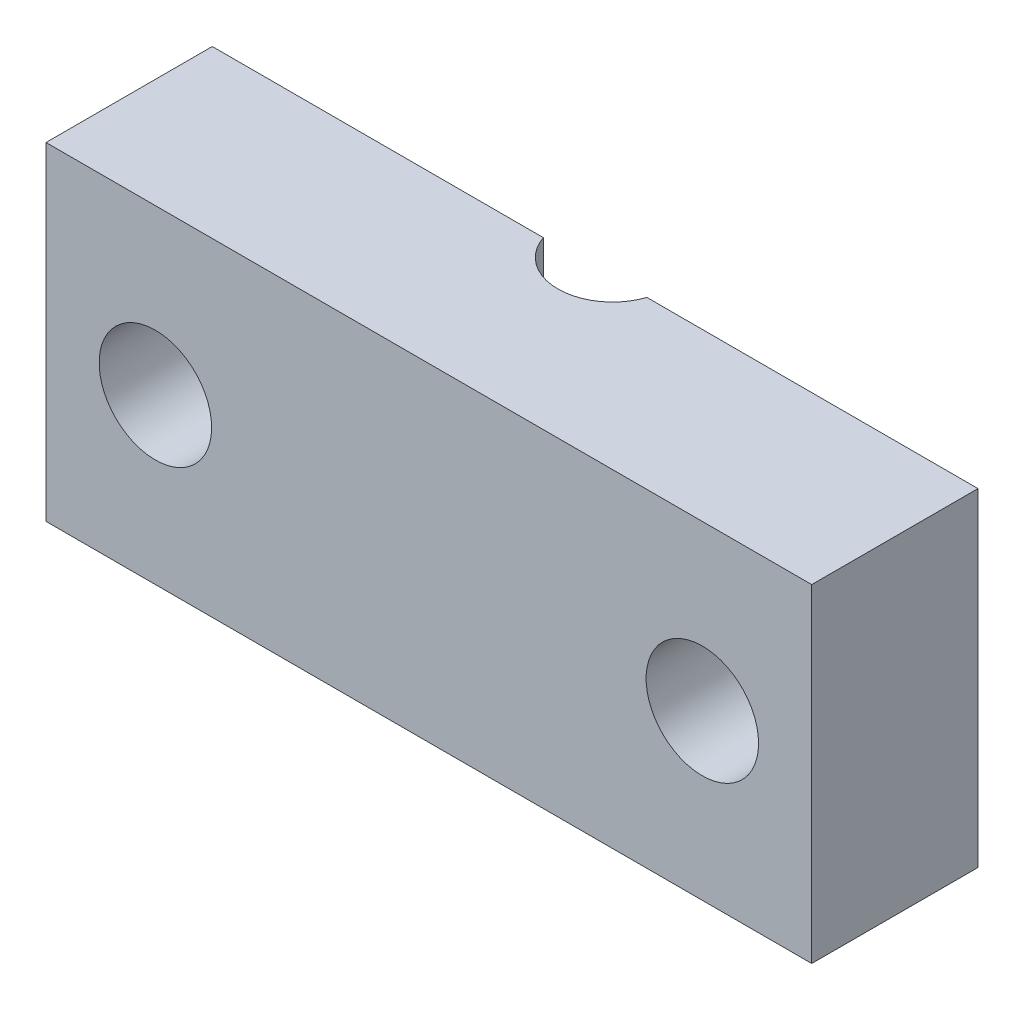
ISO-10303-21;
HEADER;
FILE_DESCRIPTION(('STEP AP214'),'2;1');
FILE_NAME('part.step','',(''),(''),'','','');
FILE_SCHEMA(('AUTOMOTIVE_DESIGN { 1 0 10303 214 1 1 1 1 }'));
ENDSEC;
DATA;
#1=APPLICATION_CONTEXT('core data for automotive mechanical design processes');
#2=APPLICATION_PROTOCOL_DEFINITION('international standard','automotive_design',2000,#1);
#3=PRODUCT_CONTEXT('',#1,'mechanical');
#4=PRODUCT('Part','Part','',(#3));
#5=PRODUCT_RELATED_PRODUCT_CATEGORY('part','',(#4));
#6=PRODUCT_DEFINITION_FORMATION('','',#4);
#7=PRODUCT_DEFINITION_CONTEXT('part definition',#1,'design');
#8=PRODUCT_DEFINITION('design','',#6,#7);
#9=PRODUCT_DEFINITION_SHAPE('','',#8);
#10=(LENGTH_UNIT() NAMED_UNIT(*) SI_UNIT(.MILLI.,.METRE.));
#11=(NAMED_UNIT(*) PLANE_ANGLE_UNIT() SI_UNIT($,.RADIAN.));
#12=(NAMED_UNIT(*) SI_UNIT($,.STERADIAN.) SOLID_ANGLE_UNIT());
#13=UNCERTAINTY_MEASURE_WITH_UNIT(LENGTH_MEASURE(1.E-05),#10,'distance_accuracy_value','');
#14=(GEOMETRIC_REPRESENTATION_CONTEXT(3) GLOBAL_UNCERTAINTY_ASSIGNED_CONTEXT((#13)) GLOBAL_UNIT_ASSIGNED_CONTEXT((#10,
#11,#12)) REPRESENTATION_CONTEXT('',''));
#15=CARTESIAN_POINT('',(0.,0.,0.));
#16=DIRECTION('',(0.,0.,1.));
#17=DIRECTION('',(1.,0.,0.));
#18=AXIS2_PLACEMENT_3D('',#15,#16,#17);
#19=CARTESIAN_POINT('',(-25.2368326571727,19.05,7.68795930098237));
#20=DIRECTION('',(0.,-1.,0.));
#21=DIRECTION('',(0.,0.,-1.));
#22=AXIS2_PLACEMENT_3D('',#19,#20,#21);
#23=CYLINDRICAL_SURFACE('',#22,3.175);
#24=CARTESIAN_POINT('',(-25.2368326571727,0.,7.68795930098237));
#25=DIRECTION('',(0.,1.,0.));
#26=DIRECTION('',(0.,0.,1.));
#27=AXIS2_PLACEMENT_3D('',#24,#25,#26);
#28=CIRCLE('',#27,3.175);
#29=CARTESIAN_POINT('',(-28.2448833548837,0.,8.70395930098237));
#30=VERTEX_POINT('',#29);
#31=CARTESIAN_POINT('',(-22.2287819594616,0.,8.70395930098237));
#32=VERTEX_POINT('',#31);
#33=EDGE_CURVE('E120',#30,#32,#28,.T.);
#34=ORIENTED_EDGE('',*,*,#33,.F.);
#35=DIRECTION('',(0.,-1.,0.));
#36=VECTOR('',#35,1.);
#37=CARTESIAN_POINT('',(-28.2448833548837,19.05,8.70395930098237));
#38=LINE('',#37,#36);
#39=CARTESIAN_POINT('',(-28.2448833548837,19.05,8.70395930098237));
#40=VERTEX_POINT('',#39);
#41=EDGE_CURVE('E11',#40,#30,#38,.T.);
#42=ORIENTED_EDGE('',*,*,#41,.F.);
#43=CARTESIAN_POINT('',(-25.2368326571727,19.05,7.68795930098237));
#44=DIRECTION('',(0.,1.,0.));
#45=DIRECTION('',(0.,0.,1.));
#46=AXIS2_PLACEMENT_3D('',#43,#44,#45);
#47=CIRCLE('',#46,3.175);
#48=CARTESIAN_POINT('',(-22.2287819594616,19.05,8.70395930098237));
#49=VERTEX_POINT('',#48);
#50=EDGE_CURVE('E145',#40,#49,#47,.T.);
#51=ORIENTED_EDGE('',*,*,#50,.T.);
#52=DIRECTION('',(0.,-1.,0.));
#53=VECTOR('',#52,1.);
#54=CARTESIAN_POINT('',(-22.2287819594616,19.05,8.70395930098237));
#55=LINE('',#54,#53);
#56=EDGE_CURVE('E53',#49,#32,#55,.T.);
#57=ORIENTED_EDGE('',*,*,#56,.T.);
#58=EDGE_LOOP('',(#34,#42,#51,#57));
#59=FACE_BOUND('',#58,.T.);
#60=ADVANCED_FACE('F36',(#59),#23,.F.);
#61=CARTESIAN_POINT('',(0.,19.05,8.70395930098237));
#62=DIRECTION('',(0.,0.,-1.));
#63=DIRECTION('',(-1.,0.,0.));
#64=AXIS2_PLACEMENT_3D('',#61,#62,#63);
#65=PLANE('',#64);
#66=CARTESIAN_POINT('',(-41.1118326571727,9.525,8.70395930098237));
#67=DIRECTION('',(0.,0.,-1.));
#68=DIRECTION('',(-1.,0.,0.));
#69=AXIS2_PLACEMENT_3D('',#66,#67,#68);
#70=CIRCLE('',#69,3.2639);
#71=CARTESIAN_POINT('',(-44.3757326571727,9.525,8.70395930098237));
#72=VERTEX_POINT('',#71);
#73=EDGE_CURVE('E151',#72,#72,#70,.T.);
#74=ORIENTED_EDGE('',*,*,#73,.F.);
#75=EDGE_LOOP('',(#74));
#76=FACE_BOUND('',#75,.T.);
#77=DIRECTION('',(1.,0.,0.));
#78=VECTOR('',#77,1.);
#79=CARTESIAN_POINT('',(0.,0.,8.70395930098237));
#80=LINE('',#79,#78);
#81=CARTESIAN_POINT('',(-47.4618326571727,0.,8.70395930098237));
#82=VERTEX_POINT('',#81);
#83=EDGE_CURVE('E122',#82,#30,#80,.T.);
#84=ORIENTED_EDGE('',*,*,#83,.F.);
#85=DIRECTION('',(0.,-1.,0.));
#86=VECTOR('',#85,1.);
#87=CARTESIAN_POINT('',(-47.4618326571727,19.05,8.70395930098237));
#88=LINE('',#87,#86);
#89=CARTESIAN_POINT('',(-47.4618326571727,19.05,8.70395930098237));
#90=VERTEX_POINT('',#89);
#91=EDGE_CURVE('E45',#90,#82,#88,.T.);
#92=ORIENTED_EDGE('',*,*,#91,.F.);
#93=DIRECTION('',(1.,0.,0.));
#94=VECTOR('',#93,1.);
#95=CARTESIAN_POINT('',(0.,19.05,8.70395930098237));
#96=LINE('',#95,#94);
#97=EDGE_CURVE('E117',#90,#40,#96,.T.);
#98=ORIENTED_EDGE('',*,*,#97,.T.);
#99=ORIENTED_EDGE('',*,*,#41,.T.);
#100=EDGE_LOOP('',(#84,#92,#98,#99));
#101=FACE_BOUND('',#100,.T.);
#102=ADVANCED_FACE('F142',(#76,#101),#65,.T.);
#103=CARTESIAN_POINT('',(-47.4618326571727,19.05,0.));
#104=DIRECTION('',(1.,0.,0.));
#105=DIRECTION('',(0.,0.,-1.));
#106=AXIS2_PLACEMENT_3D('',#103,#104,#105);
#107=PLANE('',#106);
#108=DIRECTION('',(0.,0.,1.));
#109=VECTOR('',#108,1.);
#110=CARTESIAN_POINT('',(-47.4618326571727,0.,0.));
#111=LINE('',#110,#109);
#112=CARTESIAN_POINT('',(-47.4618326571727,0.,18.3559593009824));
#113=VERTEX_POINT('',#112);
#114=EDGE_CURVE('E125',#82,#113,#111,.T.);
#115=ORIENTED_EDGE('',*,*,#114,.T.);
#116=DIRECTION('',(0.,-1.,0.));
#117=VECTOR('',#116,1.);
#118=CARTESIAN_POINT('',(-47.4618326571727,19.05,18.3559593009824));
#119=LINE('',#118,#117);
#120=CARTESIAN_POINT('',(-47.4618326571727,19.05,18.3559593009824));
#121=VERTEX_POINT('',#120);
#122=EDGE_CURVE('E111',#121,#113,#119,.T.);
#123=ORIENTED_EDGE('',*,*,#122,.F.);
#124=DIRECTION('',(0.,0.,1.));
#125=VECTOR('',#124,1.);
#126=CARTESIAN_POINT('',(-47.4618326571727,19.05,0.));
#127=LINE('',#126,#125);
#128=EDGE_CURVE('E99',#90,#121,#127,.T.);
#129=ORIENTED_EDGE('',*,*,#128,.F.);
#130=ORIENTED_EDGE('',*,*,#91,.T.);
#131=EDGE_LOOP('',(#115,#123,#129,#130));
#132=FACE_BOUND('',#131,.T.);
#133=ADVANCED_FACE('F136',(#132),#107,.F.);
#134=CARTESIAN_POINT('',(0.,19.05,18.3559593009824));
#135=DIRECTION('',(0.,0.,-1.));
#136=DIRECTION('',(-1.,0.,0.));
#137=AXIS2_PLACEMENT_3D('',#134,#135,#136);
#138=PLANE('',#137);
#139=CARTESIAN_POINT('',(-41.1118326571727,9.525,18.3559593009824));
#140=DIRECTION('',(0.,0.,1.));
#141=DIRECTION('',(1.,0.,0.));
#142=AXIS2_PLACEMENT_3D('',#139,#140,#141);
#143=CIRCLE('',#142,3.2639);
#144=CARTESIAN_POINT('',(-37.8479326571727,9.525,18.3559593009824));
#145=VERTEX_POINT('',#144);
#146=EDGE_CURVE('E154',#145,#145,#143,.T.);
#147=ORIENTED_EDGE('',*,*,#146,.F.);
#148=EDGE_LOOP('',(#147));
#149=FACE_BOUND('',#148,.T.);
#150=CARTESIAN_POINT('',(-9.36183265717268,9.525,18.3559593009824));
#151=DIRECTION('',(0.,0.,1.));
#152=DIRECTION('',(1.,0.,0.));
#153=AXIS2_PLACEMENT_3D('',#150,#151,#152);
#154=CIRCLE('',#153,3.2639);
#155=CARTESIAN_POINT('',(-6.09793265717268,9.525,18.3559593009824));
#156=VERTEX_POINT('',#155);
#157=EDGE_CURVE('E148',#156,#156,#154,.T.);
#158=ORIENTED_EDGE('',*,*,#157,.F.);
#159=EDGE_LOOP('',(#158));
#160=FACE_BOUND('',#159,.T.);
#161=DIRECTION('',(1.,0.,0.));
#162=VECTOR('',#161,1.);
#163=CARTESIAN_POINT('',(0.,0.,18.3559593009824));
#164=LINE('',#163,#162);
#165=CARTESIAN_POINT('',(-3.01183265717268,0.,18.3559593009824));
#166=VERTEX_POINT('',#165);
#167=EDGE_CURVE('E108',#113,#166,#164,.T.);
#168=ORIENTED_EDGE('',*,*,#167,.T.);
#169=DIRECTION('',(0.,-1.,0.));
#170=VECTOR('',#169,1.);
#171=CARTESIAN_POINT('',(-3.01183265717268,19.05,18.3559593009824));
#172=LINE('',#171,#170);
#173=CARTESIAN_POINT('',(-3.01183265717268,19.05,18.3559593009824));
#174=VERTEX_POINT('',#173);
#175=EDGE_CURVE('E105',#174,#166,#172,.T.);
#176=ORIENTED_EDGE('',*,*,#175,.F.);
#177=DIRECTION('',(1.,0.,0.));
#178=VECTOR('',#177,1.);
#179=CARTESIAN_POINT('',(0.,19.05,18.3559593009824));
#180=LINE('',#179,#178);
#181=EDGE_CURVE('E91',#121,#174,#180,.T.);
#182=ORIENTED_EDGE('',*,*,#181,.F.);
#183=ORIENTED_EDGE('',*,*,#122,.T.);
#184=EDGE_LOOP('',(#168,#176,#182,#183));
#185=FACE_BOUND('',#184,.T.);
#186=ADVANCED_FACE('F106',(#149,#160,#185),#138,.F.);
#187=CARTESIAN_POINT('',(-3.01183265717268,19.05,0.));
#188=DIRECTION('',(1.,0.,0.));
#189=DIRECTION('',(0.,0.,-1.));
#190=AXIS2_PLACEMENT_3D('',#187,#188,#189);
#191=PLANE('',#190);
#192=DIRECTION('',(0.,0.,1.));
#193=VECTOR('',#192,1.);
#194=CARTESIAN_POINT('',(-3.01183265717268,0.,0.));
#195=LINE('',#194,#193);
#196=CARTESIAN_POINT('',(-3.01183265717268,0.,8.70395930098237));
#197=VERTEX_POINT('',#196);
#198=EDGE_CURVE('E129',#197,#166,#195,.T.);
#199=ORIENTED_EDGE('',*,*,#198,.F.);
#200=DIRECTION('',(0.,-1.,0.));
#201=VECTOR('',#200,1.);
#202=CARTESIAN_POINT('',(-3.01183265717268,19.05,8.70395930098237));
#203=LINE('',#202,#201);
#204=CARTESIAN_POINT('',(-3.01183265717268,19.05,8.70395930098237));
#205=VERTEX_POINT('',#204);
#206=EDGE_CURVE('E72',#205,#197,#203,.T.);
#207=ORIENTED_EDGE('',*,*,#206,.F.);
#208=DIRECTION('',(0.,0.,1.));
#209=VECTOR('',#208,1.);
#210=CARTESIAN_POINT('',(-3.01183265717268,19.05,0.));
#211=LINE('',#210,#209);
#212=EDGE_CURVE('E96',#205,#174,#211,.T.);
#213=ORIENTED_EDGE('',*,*,#212,.T.);
#214=ORIENTED_EDGE('',*,*,#175,.T.);
#215=EDGE_LOOP('',(#199,#207,#213,#214));
#216=FACE_BOUND('',#215,.T.);
#217=ADVANCED_FACE('F113',(#216),#191,.T.);
#218=CARTESIAN_POINT('',(-9.36183265717268,9.525,8.70395930098237));
#219=DIRECTION('',(0.,0.,-1.));
#220=DIRECTION('',(-1.,0.,0.));
#221=AXIS2_PLACEMENT_3D('',#218,#219,#220);
#222=CIRCLE('',#221,3.2639);
#223=CARTESIAN_POINT('',(-12.6257326571727,9.525,8.70395930098237));
#224=VERTEX_POINT('',#223);
#225=EDGE_CURVE('E39',#224,#224,#222,.T.);
#226=ORIENTED_EDGE('',*,*,#225,.F.);
#227=EDGE_LOOP('',(#226));
#228=FACE_BOUND('',#227,.T.);
#229=EDGE_CURVE('E126',#32,#197,#80,.T.);
#230=ORIENTED_EDGE('',*,*,#229,.F.);
#231=ORIENTED_EDGE('',*,*,#56,.F.);
#232=EDGE_CURVE('E114',#49,#205,#96,.T.);
#233=ORIENTED_EDGE('',*,*,#232,.T.);
#234=ORIENTED_EDGE('',*,*,#206,.T.);
#235=EDGE_LOOP('',(#230,#231,#233,#234));
#236=FACE_BOUND('',#235,.T.);
#237=ADVANCED_FACE('F144',(#228,#236),#65,.T.);
#238=CARTESIAN_POINT('',(0.,19.05,0.));
#239=DIRECTION('',(0.,1.,0.));
#240=DIRECTION('',(0.,0.,1.));
#241=AXIS2_PLACEMENT_3D('',#238,#239,#240);
#242=PLANE('',#241);
#243=ORIENTED_EDGE('',*,*,#50,.F.);
#244=ORIENTED_EDGE('',*,*,#97,.F.);
#245=ORIENTED_EDGE('',*,*,#128,.T.);
#246=ORIENTED_EDGE('',*,*,#181,.T.);
#247=ORIENTED_EDGE('',*,*,#212,.F.);
#248=ORIENTED_EDGE('',*,*,#232,.F.);
#249=EDGE_LOOP('',(#243,#244,#245,#246,#247,#248));
#250=FACE_BOUND('',#249,.T.);
#251=ADVANCED_FACE('F93',(#250),#242,.T.);
#252=CARTESIAN_POINT('',(0.,0.,0.));
#253=DIRECTION('',(0.,1.,0.));
#254=DIRECTION('',(0.,0.,1.));
#255=AXIS2_PLACEMENT_3D('',#252,#253,#254);
#256=PLANE('',#255);
#257=ORIENTED_EDGE('',*,*,#33,.T.);
#258=ORIENTED_EDGE('',*,*,#229,.T.);
#259=ORIENTED_EDGE('',*,*,#198,.T.);
#260=ORIENTED_EDGE('',*,*,#167,.F.);
#261=ORIENTED_EDGE('',*,*,#114,.F.);
#262=ORIENTED_EDGE('',*,*,#83,.T.);
#263=EDGE_LOOP('',(#257,#258,#259,#260,#261,#262));
#264=FACE_BOUND('',#263,.T.);
#265=ADVANCED_FACE('F141',(#264),#256,.F.);
#266=CARTESIAN_POINT('',(-9.36183265717268,9.525,6.67195930098237));
#267=DIRECTION('',(0.,0.,1.));
#268=DIRECTION('',(1.,0.,0.));
#269=AXIS2_PLACEMENT_3D('',#266,#267,#268);
#270=CYLINDRICAL_SURFACE('',#269,3.2639);
#271=ORIENTED_EDGE('',*,*,#225,.T.);
#272=EDGE_LOOP('',(#271));
#273=FACE_BOUND('',#272,.T.);
#274=ORIENTED_EDGE('',*,*,#157,.T.);
#275=EDGE_LOOP('',(#274));
#276=FACE_BOUND('',#275,.T.);
#277=ADVANCED_FACE('F165',(#273,#276),#270,.F.);
#278=CARTESIAN_POINT('',(-41.1118326571727,9.525,6.67195930098237));
#279=DIRECTION('',(0.,0.,1.));
#280=DIRECTION('',(1.,0.,0.));
#281=AXIS2_PLACEMENT_3D('',#278,#279,#280);
#282=CYLINDRICAL_SURFACE('',#281,3.2639);
#283=ORIENTED_EDGE('',*,*,#73,.T.);
#284=EDGE_LOOP('',(#283));
#285=FACE_BOUND('',#284,.T.);
#286=ORIENTED_EDGE('',*,*,#146,.T.);
#287=EDGE_LOOP('',(#286));
#288=FACE_BOUND('',#287,.T.);
#289=ADVANCED_FACE('F158',(#285,#288),#282,.F.);
#290=CLOSED_SHELL('',(#60,#102,#133,#186,#217,#237,#251,#265,#277,#289));
#291=MANIFOLD_SOLID_BREP('B2',#290);
#292=ADVANCED_BREP_SHAPE_REPRESENTATION('',(#18,#291),#14);
#293=SHAPE_DEFINITION_REPRESENTATION(#9,#292);
ENDSEC;
END-ISO-10303-21;
